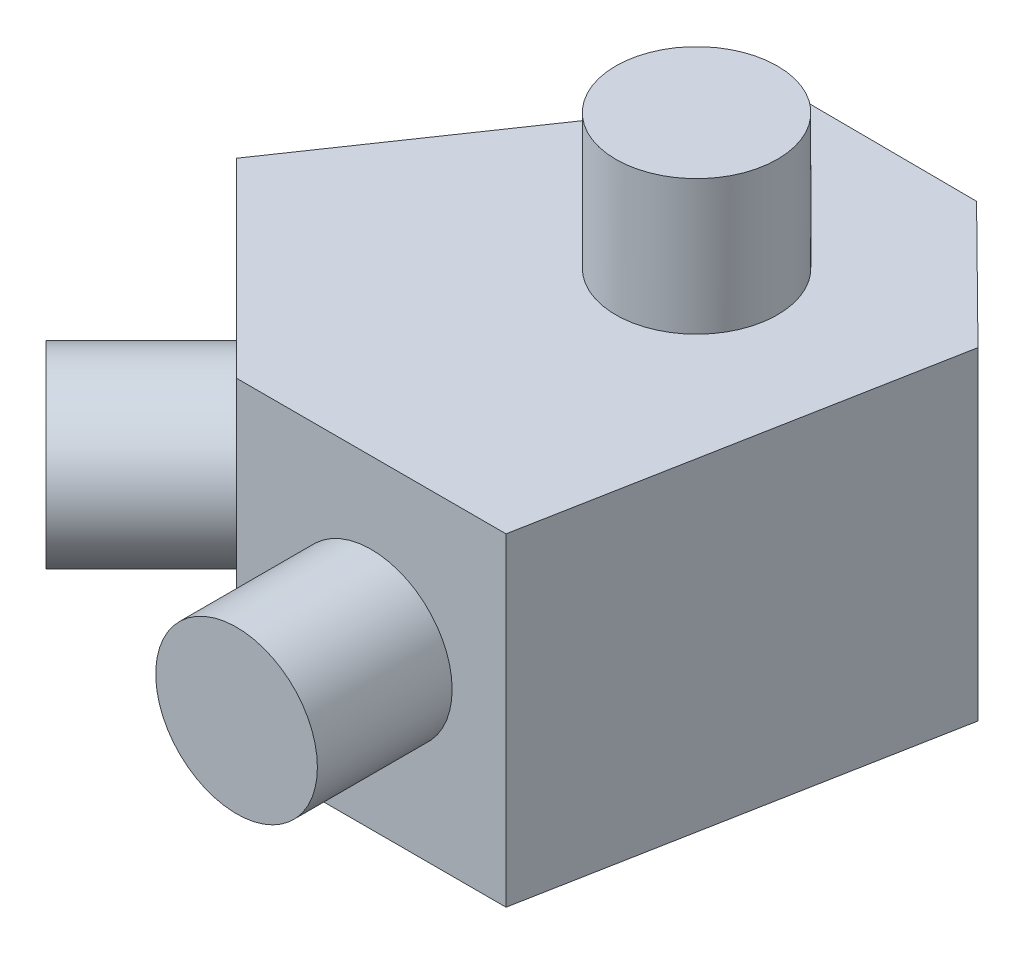
ISO-10303-21;
HEADER;
FILE_DESCRIPTION(('STEP AP214'),'2;1');
FILE_NAME('part.step','',(''),(''),'','','');
FILE_SCHEMA(('AUTOMOTIVE_DESIGN { 1 0 10303 214 1 1 1 1 }'));
ENDSEC;
DATA;
#1=APPLICATION_CONTEXT('core data for automotive mechanical design processes');
#2=APPLICATION_PROTOCOL_DEFINITION('international standard','automotive_design',2000,#1);
#3=PRODUCT_CONTEXT('',#1,'mechanical');
#4=PRODUCT('Part','Part','',(#3));
#5=PRODUCT_RELATED_PRODUCT_CATEGORY('part','',(#4));
#6=PRODUCT_DEFINITION_FORMATION('','',#4);
#7=PRODUCT_DEFINITION_CONTEXT('part definition',#1,'design');
#8=PRODUCT_DEFINITION('design','',#6,#7);
#9=PRODUCT_DEFINITION_SHAPE('','',#8);
#10=(LENGTH_UNIT() NAMED_UNIT(*) SI_UNIT(.MILLI.,.METRE.));
#11=(NAMED_UNIT(*) PLANE_ANGLE_UNIT() SI_UNIT($,.RADIAN.));
#12=(NAMED_UNIT(*) SI_UNIT($,.STERADIAN.) SOLID_ANGLE_UNIT());
#13=UNCERTAINTY_MEASURE_WITH_UNIT(LENGTH_MEASURE(1.E-05),#10,'distance_accuracy_value','');
#14=(GEOMETRIC_REPRESENTATION_CONTEXT(3) GLOBAL_UNCERTAINTY_ASSIGNED_CONTEXT((#13)) GLOBAL_UNIT_ASSIGNED_CONTEXT((#10,
#11,#12)) REPRESENTATION_CONTEXT('',''));
#15=CARTESIAN_POINT('',(0.,0.,0.));
#16=DIRECTION('',(0.,0.,1.));
#17=DIRECTION('',(1.,0.,0.));
#18=AXIS2_PLACEMENT_3D('',#15,#16,#17);
#19=CARTESIAN_POINT('',(-8.98025612106914,15.24,-8.98025612106917));
#20=DIRECTION('',(0.825590014243493,0.,0.564270439046234));
#21=DIRECTION('',(0.564270439046234,0.,-0.825590014243493));
#22=AXIS2_PLACEMENT_3D('',#19,#20,#21);
#23=PLANE('',#22);
#24=DIRECTION('',(-0.564270439046234,0.,0.825590014243493));
#25=VECTOR('',#24,1.);
#26=CARTESIAN_POINT('',(-8.98025612106914,0.,-8.98025612106917));
#27=LINE('',#26,#25);
#28=CARTESIAN_POINT('',(1.76909574276162,0.,-24.7077458924077));
#29=VERTEX_POINT('',#28);
#30=CARTESIAN_POINT('',(-8.98025612106914,0.,-8.98025612106917));
#31=VERTEX_POINT('',#30);
#32=EDGE_CURVE('E117',#29,#31,#27,.T.);
#33=ORIENTED_EDGE('',*,*,#32,.T.);
#34=DIRECTION('',(0.,-1.,0.));
#35=VECTOR('',#34,1.);
#36=CARTESIAN_POINT('',(-8.98025612106914,15.24,-8.98025612106917));
#37=LINE('',#36,#35);
#38=CARTESIAN_POINT('',(-8.98025612106914,15.24,-8.98025612106917));
#39=VERTEX_POINT('',#38);
#40=EDGE_CURVE('E134',#39,#31,#37,.T.);
#41=ORIENTED_EDGE('',*,*,#40,.F.);
#42=DIRECTION('',(-0.564270439046234,0.,0.825590014243493));
#43=VECTOR('',#42,1.);
#44=CARTESIAN_POINT('',(-8.98025612106914,15.24,-8.98025612106917));
#45=LINE('',#44,#43);
#46=CARTESIAN_POINT('',(1.76909574276162,15.24,-24.7077458924077));
#47=VERTEX_POINT('',#46);
#48=EDGE_CURVE('E128',#47,#39,#45,.T.);
#49=ORIENTED_EDGE('',*,*,#48,.F.);
#50=DIRECTION('',(0.,-1.,0.));
#51=VECTOR('',#50,1.);
#52=CARTESIAN_POINT('',(1.76909574276162,15.24,-24.7077458924077));
#53=LINE('',#52,#51);
#54=EDGE_CURVE('E113',#47,#29,#53,.T.);
#55=ORIENTED_EDGE('',*,*,#54,.T.);
#56=EDGE_LOOP('',(#33,#41,#49,#55));
#57=FACE_BOUND('',#56,.T.);
#58=ADVANCED_FACE('F32',(#57),#23,.F.);
#59=CARTESIAN_POINT('',(-8.98025612106914,15.24,-8.98025612106917));
#60=DIRECTION('',(0.707106781186549,0.,-0.707106781186546));
#61=DIRECTION('',(-0.707106781186546,0.,-0.707106781186549));
#62=AXIS2_PLACEMENT_3D('',#59,#60,#61);
#63=PLANE('',#62);
#64=CARTESIAN_POINT('',(-4.49012806053461,7.62,-4.49012806053455));
#65=DIRECTION('',(0.707106781186543,0.,-0.707106781186552));
#66=DIRECTION('',(-0.707106781186552,0.,-0.707106781186543));
#67=AXIS2_PLACEMENT_3D('',#64,#65,#66);
#68=CIRCLE('',#67,3.81);
#69=CARTESIAN_POINT('',(-7.18420489685537,7.62,-7.18420489685527));
#70=VERTEX_POINT('',#69);
#71=EDGE_CURVE('E278',#70,#70,#68,.T.);
#72=ORIENTED_EDGE('',*,*,#71,.T.);
#73=EDGE_LOOP('',(#72));
#74=FACE_BOUND('',#73,.T.);
#75=DIRECTION('',(0.707106781186546,0.,0.707106781186549));
#76=VECTOR('',#75,1.);
#77=CARTESIAN_POINT('',(-8.98025612106914,0.,-8.98025612106917));
#78=LINE('',#77,#76);
#79=CARTESIAN_POINT('',(0.,0.,0.));
#80=VERTEX_POINT('',#79);
#81=EDGE_CURVE('E120',#31,#80,#78,.T.);
#82=ORIENTED_EDGE('',*,*,#81,.T.);
#83=DIRECTION('',(0.,-1.,0.));
#84=VECTOR('',#83,1.);
#85=CARTESIAN_POINT('',(0.,15.24,0.));
#86=LINE('',#85,#84);
#87=CARTESIAN_POINT('',(0.,15.24,0.));
#88=VERTEX_POINT('',#87);
#89=EDGE_CURVE('E132',#88,#80,#86,.T.);
#90=ORIENTED_EDGE('',*,*,#89,.F.);
#91=DIRECTION('',(0.707106781186546,0.,0.707106781186549));
#92=VECTOR('',#91,1.);
#93=CARTESIAN_POINT('',(-8.98025612106914,15.24,-8.98025612106917));
#94=LINE('',#93,#92);
#95=EDGE_CURVE('E86',#39,#88,#94,.T.);
#96=ORIENTED_EDGE('',*,*,#95,.F.);
#97=ORIENTED_EDGE('',*,*,#40,.T.);
#98=EDGE_LOOP('',(#82,#90,#96,#97));
#99=FACE_BOUND('',#98,.T.);
#100=ADVANCED_FACE('F145',(#74,#99),#63,.F.);
#101=CARTESIAN_POINT('',(0.,15.24,0.));
#102=DIRECTION('',(0.,0.,-1.));
#103=DIRECTION('',(-1.,0.,0.));
#104=AXIS2_PLACEMENT_3D('',#101,#102,#103);
#105=PLANE('',#104);
#106=CARTESIAN_POINT('',(6.35,7.62,0.));
#107=DIRECTION('',(0.,0.,1.));
#108=DIRECTION('',(1.,0.,0.));
#109=AXIS2_PLACEMENT_3D('',#106,#107,#108);
#110=CIRCLE('',#109,3.81);
#111=CARTESIAN_POINT('',(10.16,7.62,0.));
#112=VERTEX_POINT('',#111);
#113=EDGE_CURVE('E40',#112,#112,#110,.T.);
#114=ORIENTED_EDGE('',*,*,#113,.F.);
#115=EDGE_LOOP('',(#114));
#116=FACE_BOUND('',#115,.T.);
#117=DIRECTION('',(1.,0.,0.));
#118=VECTOR('',#117,1.);
#119=CARTESIAN_POINT('',(0.,0.,0.));
#120=LINE('',#119,#118);
#121=CARTESIAN_POINT('',(12.7,0.,0.));
#122=VERTEX_POINT('',#121);
#123=EDGE_CURVE('E123',#80,#122,#120,.T.);
#124=ORIENTED_EDGE('',*,*,#123,.T.);
#125=DIRECTION('',(0.,-1.,0.));
#126=VECTOR('',#125,1.);
#127=CARTESIAN_POINT('',(12.7,15.24,0.));
#128=LINE('',#127,#126);
#129=CARTESIAN_POINT('',(12.7,15.24,0.));
#130=VERTEX_POINT('',#129);
#131=EDGE_CURVE('E108',#130,#122,#128,.T.);
#132=ORIENTED_EDGE('',*,*,#131,.F.);
#133=DIRECTION('',(1.,0.,0.));
#134=VECTOR('',#133,1.);
#135=CARTESIAN_POINT('',(0.,15.24,0.));
#136=LINE('',#135,#134);
#137=EDGE_CURVE('E99',#88,#130,#136,.T.);
#138=ORIENTED_EDGE('',*,*,#137,.F.);
#139=ORIENTED_EDGE('',*,*,#89,.T.);
#140=EDGE_LOOP('',(#124,#132,#138,#139));
#141=FACE_BOUND('',#140,.T.);
#142=ADVANCED_FACE('F148',(#116,#141),#105,.F.);
#143=CARTESIAN_POINT('',(16.2200750720803,15.24,-18.7219542646306));
#144=DIRECTION('',(-0.982779751424177,0.,-0.184780843678758));
#145=DIRECTION('',(-0.184780843678758,0.,0.982779751424177));
#146=AXIS2_PLACEMENT_3D('',#143,#144,#145);
#147=PLANE('',#146);
#148=DIRECTION('',(0.184780843678758,0.,-0.982779751424177));
#149=VECTOR('',#148,1.);
#150=CARTESIAN_POINT('',(16.2200750720803,0.,-18.7219542646306));
#151=LINE('',#150,#149);
#152=CARTESIAN_POINT('',(16.2200750720803,0.,-18.7219542646306));
#153=VERTEX_POINT('',#152);
#154=EDGE_CURVE('E107',#122,#153,#151,.T.);
#155=ORIENTED_EDGE('',*,*,#154,.T.);
#156=DIRECTION('',(0.,-1.,0.));
#157=VECTOR('',#156,1.);
#158=CARTESIAN_POINT('',(16.2200750720803,15.24,-18.7219542646306));
#159=LINE('',#158,#157);
#160=CARTESIAN_POINT('',(16.2200750720803,15.24,-18.7219542646306));
#161=VERTEX_POINT('',#160);
#162=EDGE_CURVE('E104',#161,#153,#159,.T.);
#163=ORIENTED_EDGE('',*,*,#162,.F.);
#164=DIRECTION('',(0.184780843678758,0.,-0.982779751424177));
#165=VECTOR('',#164,1.);
#166=CARTESIAN_POINT('',(16.2200750720803,15.24,-18.7219542646306));
#167=LINE('',#166,#165);
#168=EDGE_CURVE('E93',#130,#161,#167,.T.);
#169=ORIENTED_EDGE('',*,*,#168,.F.);
#170=ORIENTED_EDGE('',*,*,#131,.T.);
#171=EDGE_LOOP('',(#155,#163,#169,#170));
#172=FACE_BOUND('',#171,.T.);
#173=ADVANCED_FACE('F105',(#172),#147,.F.);
#174=CARTESIAN_POINT('',(10.2143313759175,15.24,-24.6595773383132));
#175=DIRECTION('',(-0.703062265418316,0.,0.711128294293558));
#176=DIRECTION('',(0.711128294293558,0.,0.703062265418316));
#177=AXIS2_PLACEMENT_3D('',#174,#175,#176);
#178=PLANE('',#177);
#179=DIRECTION('',(-0.711128294293558,0.,-0.703062265418316));
#180=VECTOR('',#179,1.);
#181=CARTESIAN_POINT('',(10.2143313759175,0.,-24.6595773383132));
#182=LINE('',#181,#180);
#183=CARTESIAN_POINT('',(10.2143313759175,0.,-24.6595773383132));
#184=VERTEX_POINT('',#183);
#185=EDGE_CURVE('E71',#153,#184,#182,.T.);
#186=ORIENTED_EDGE('',*,*,#185,.T.);
#187=DIRECTION('',(0.,-1.,0.));
#188=VECTOR('',#187,1.);
#189=CARTESIAN_POINT('',(10.2143313759175,15.24,-24.6595773383132));
#190=LINE('',#189,#188);
#191=CARTESIAN_POINT('',(10.2143313759175,15.24,-24.6595773383132));
#192=VERTEX_POINT('',#191);
#193=EDGE_CURVE('E109',#192,#184,#190,.T.);
#194=ORIENTED_EDGE('',*,*,#193,.F.);
#195=DIRECTION('',(-0.711128294293558,0.,-0.703062265418316));
#196=VECTOR('',#195,1.);
#197=CARTESIAN_POINT('',(10.2143313759175,15.24,-24.6595773383132));
#198=LINE('',#197,#196);
#199=EDGE_CURVE('E97',#161,#192,#198,.T.);
#200=ORIENTED_EDGE('',*,*,#199,.F.);
#201=ORIENTED_EDGE('',*,*,#162,.T.);
#202=EDGE_LOOP('',(#186,#194,#200,#201));
#203=FACE_BOUND('',#202,.T.);
#204=ADVANCED_FACE('F111',(#203),#178,.F.);
#205=CARTESIAN_POINT('',(1.76909574276162,15.24,-24.7077458924077));
#206=DIRECTION('',(-0.00570354371493823,0.,0.999983734662265));
#207=DIRECTION('',(0.999983734662265,0.,0.00570354371493823));
#208=AXIS2_PLACEMENT_3D('',#205,#206,#207);
#209=PLANE('',#208);
#210=DIRECTION('',(-0.999983734662265,0.,-0.00570354371493823));
#211=VECTOR('',#210,1.);
#212=CARTESIAN_POINT('',(1.76909574276162,0.,-24.7077458924077));
#213=LINE('',#212,#211);
#214=EDGE_CURVE('E77',#184,#29,#213,.T.);
#215=ORIENTED_EDGE('',*,*,#214,.T.);
#216=ORIENTED_EDGE('',*,*,#54,.F.);
#217=DIRECTION('',(-0.999983734662265,0.,-0.00570354371493823));
#218=VECTOR('',#217,1.);
#219=CARTESIAN_POINT('',(1.76909574276162,15.24,-24.7077458924077));
#220=LINE('',#219,#218);
#221=EDGE_CURVE('E48',#192,#47,#220,.T.);
#222=ORIENTED_EDGE('',*,*,#221,.F.);
#223=ORIENTED_EDGE('',*,*,#193,.T.);
#224=EDGE_LOOP('',(#215,#216,#222,#223));
#225=FACE_BOUND('',#224,.T.);
#226=ADVANCED_FACE('F153',(#225),#209,.F.);
#227=CARTESIAN_POINT('',(0.,15.24,0.));
#228=DIRECTION('',(0.,-1.,0.));
#229=DIRECTION('',(0.,0.,-1.));
#230=AXIS2_PLACEMENT_3D('',#227,#228,#229);
#231=PLANE('',#230);
#232=CARTESIAN_POINT('',(6.35,15.24,-15.3302561210691));
#233=DIRECTION('',(0.,-1.,0.));
#234=DIRECTION('',(0.,0.,-1.));
#235=AXIS2_PLACEMENT_3D('',#232,#233,#234);
#236=CIRCLE('',#235,3.81);
#237=CARTESIAN_POINT('',(6.35,15.24,-19.1402561210691));
#238=VERTEX_POINT('',#237);
#239=EDGE_CURVE('E11',#238,#238,#236,.F.);
#240=ORIENTED_EDGE('',*,*,#239,.F.);
#241=EDGE_LOOP('',(#240));
#242=FACE_BOUND('',#241,.T.);
#243=ORIENTED_EDGE('',*,*,#48,.T.);
#244=ORIENTED_EDGE('',*,*,#95,.T.);
#245=ORIENTED_EDGE('',*,*,#137,.T.);
#246=ORIENTED_EDGE('',*,*,#168,.T.);
#247=ORIENTED_EDGE('',*,*,#199,.T.);
#248=ORIENTED_EDGE('',*,*,#221,.T.);
#249=EDGE_LOOP('',(#243,#244,#245,#246,#247,#248));
#250=FACE_BOUND('',#249,.T.);
#251=ADVANCED_FACE('F95',(#242,#250),#231,.F.);
#252=CARTESIAN_POINT('',(0.,0.,0.));
#253=DIRECTION('',(0.,-1.,0.));
#254=DIRECTION('',(0.,0.,-1.));
#255=AXIS2_PLACEMENT_3D('',#252,#253,#254);
#256=PLANE('',#255);
#257=ORIENTED_EDGE('',*,*,#32,.F.);
#258=ORIENTED_EDGE('',*,*,#214,.F.);
#259=ORIENTED_EDGE('',*,*,#185,.F.);
#260=ORIENTED_EDGE('',*,*,#154,.F.);
#261=ORIENTED_EDGE('',*,*,#123,.F.);
#262=ORIENTED_EDGE('',*,*,#81,.F.);
#263=EDGE_LOOP('',(#257,#258,#259,#260,#261,#262));
#264=FACE_BOUND('',#263,.T.);
#265=ADVANCED_FACE('F151',(#264),#256,.T.);
#266=CARTESIAN_POINT('',(6.35,7.62,6.35));
#267=DIRECTION('',(0.,0.,-1.));
#268=DIRECTION('',(-1.,0.,0.));
#269=AXIS2_PLACEMENT_3D('',#266,#267,#268);
#270=CYLINDRICAL_SURFACE('',#269,3.81);
#271=CARTESIAN_POINT('',(6.35,7.62,6.35));
#272=DIRECTION('',(0.,0.,1.));
#273=DIRECTION('',(1.,0.,0.));
#274=AXIS2_PLACEMENT_3D('',#271,#272,#273);
#275=CIRCLE('',#274,3.81);
#276=CARTESIAN_POINT('',(10.16,7.62,6.35));
#277=VERTEX_POINT('',#276);
#278=EDGE_CURVE('E121',#277,#277,#275,.T.);
#279=ORIENTED_EDGE('',*,*,#278,.F.);
#280=EDGE_LOOP('',(#279));
#281=FACE_BOUND('',#280,.T.);
#282=ORIENTED_EDGE('',*,*,#113,.T.);
#283=EDGE_LOOP('',(#282));
#284=FACE_BOUND('',#283,.T.);
#285=ADVANCED_FACE('F198',(#281,#284),#270,.T.);
#286=CARTESIAN_POINT('',(6.35,7.62,6.35));
#287=DIRECTION('',(0.,0.,1.));
#288=DIRECTION('',(1.,0.,0.));
#289=AXIS2_PLACEMENT_3D('',#286,#287,#288);
#290=PLANE('',#289);
#291=ORIENTED_EDGE('',*,*,#278,.T.);
#292=EDGE_LOOP('',(#291));
#293=FACE_BOUND('',#292,.T.);
#294=ADVANCED_FACE('F212',(#293),#290,.T.);
#295=CARTESIAN_POINT('',(-8.98025612106915,7.62,0.));
#296=DIRECTION('',(0.707106781186542,0.,-0.707106781186552));
#297=DIRECTION('',(-0.707106781186552,0.,-0.707106781186543));
#298=AXIS2_PLACEMENT_3D('',#295,#296,#297);
#299=CYLINDRICAL_SURFACE('',#298,3.81);
#300=CARTESIAN_POINT('',(-8.98025612106915,7.62,0.));
#301=DIRECTION('',(0.707106781186543,0.,-0.707106781186552));
#302=DIRECTION('',(-0.707106781186552,0.,-0.707106781186543));
#303=AXIS2_PLACEMENT_3D('',#300,#301,#302);
#304=CIRCLE('',#303,3.81);
#305=CARTESIAN_POINT('',(-11.6743329573899,7.62,-2.69407683632066));
#306=VERTEX_POINT('',#305);
#307=EDGE_CURVE('E280',#306,#306,#304,.T.);
#308=ORIENTED_EDGE('',*,*,#307,.T.);
#309=EDGE_LOOP('',(#308));
#310=FACE_BOUND('',#309,.T.);
#311=ORIENTED_EDGE('',*,*,#71,.F.);
#312=EDGE_LOOP('',(#311));
#313=FACE_BOUND('',#312,.T.);
#314=ADVANCED_FACE('F221',(#310,#313),#299,.T.);
#315=CARTESIAN_POINT('',(-8.98025612106915,7.62,0.));
#316=DIRECTION('',(-0.707106781186543,0.,0.707106781186552));
#317=DIRECTION('',(-0.707106781186552,0.,-0.707106781186543));
#318=AXIS2_PLACEMENT_3D('',#315,#316,#317);
#319=PLANE('',#318);
#320=ORIENTED_EDGE('',*,*,#307,.F.);
#321=EDGE_LOOP('',(#320));
#322=FACE_BOUND('',#321,.T.);
#323=ADVANCED_FACE('F236',(#322),#319,.T.);
#324=CARTESIAN_POINT('',(6.35,21.59,-15.3302561210691));
#325=DIRECTION('',(0.,-1.,0.));
#326=DIRECTION('',(0.,0.,-1.));
#327=AXIS2_PLACEMENT_3D('',#324,#325,#326);
#328=CYLINDRICAL_SURFACE('',#327,3.81);
#329=CARTESIAN_POINT('',(6.35,21.59,-15.3302561210691));
#330=DIRECTION('',(0.,1.,0.));
#331=DIRECTION('',(0.,0.,1.));
#332=AXIS2_PLACEMENT_3D('',#329,#330,#331);
#333=CIRCLE('',#332,3.81);
#334=CARTESIAN_POINT('',(6.35,21.59,-11.5202561210691));
#335=VERTEX_POINT('',#334);
#336=EDGE_CURVE('E277',#335,#335,#333,.T.);
#337=ORIENTED_EDGE('',*,*,#336,.F.);
#338=EDGE_LOOP('',(#337));
#339=FACE_BOUND('',#338,.T.);
#340=ORIENTED_EDGE('',*,*,#239,.T.);
#341=EDGE_LOOP('',(#340));
#342=FACE_BOUND('',#341,.T.);
#343=ADVANCED_FACE('F246',(#339,#342),#328,.T.);
#344=CARTESIAN_POINT('',(6.35,21.59,-15.3302561210691));
#345=DIRECTION('',(0.,1.,0.));
#346=DIRECTION('',(0.,0.,1.));
#347=AXIS2_PLACEMENT_3D('',#344,#345,#346);
#348=PLANE('',#347);
#349=ORIENTED_EDGE('',*,*,#336,.T.);
#350=EDGE_LOOP('',(#349));
#351=FACE_BOUND('',#350,.T.);
#352=ADVANCED_FACE('F261',(#351),#348,.T.);
#353=CLOSED_SHELL('',(#58,#100,#142,#173,#204,#226,#251,#265,#285,#294,#314,#323,#343,#352));
#354=MANIFOLD_SOLID_BREP('B2',#353);
#355=ADVANCED_BREP_SHAPE_REPRESENTATION('',(#18,#354),#14);
#356=SHAPE_DEFINITION_REPRESENTATION(#9,#355);
ENDSEC;
END-ISO-10303-21;
